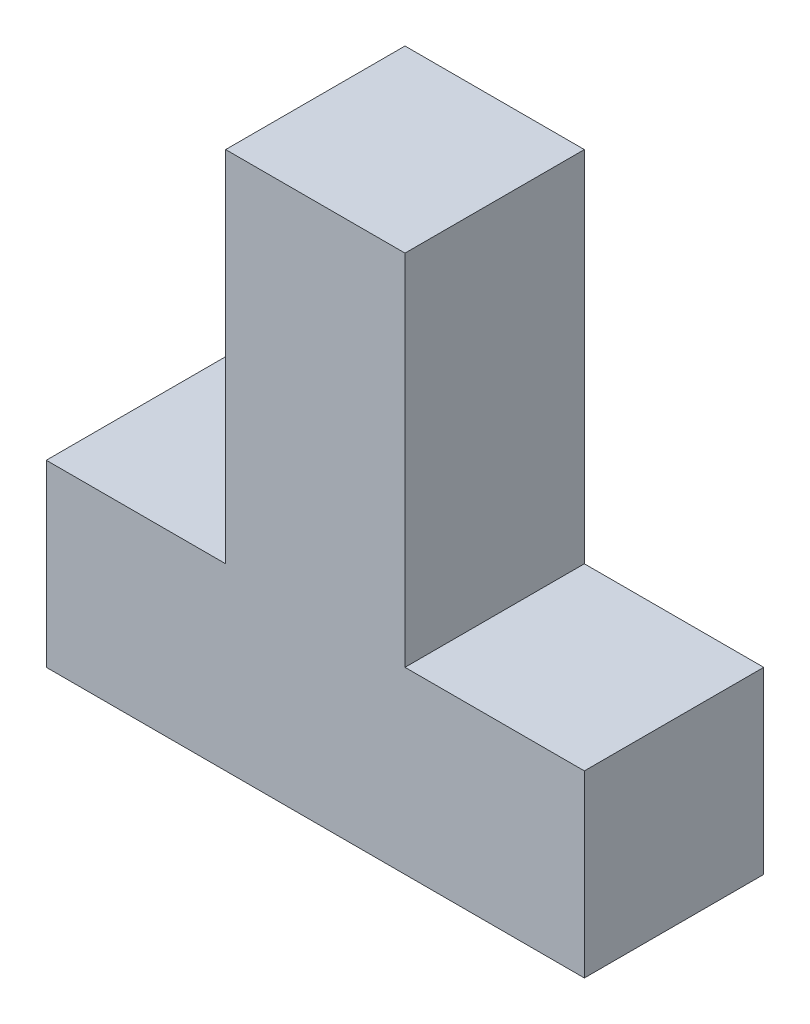
ISO-10303-21;
HEADER;
FILE_DESCRIPTION(('STEP AP214'),'2;1');
FILE_NAME('part.step','',(''),(''),'','','');
FILE_SCHEMA(('AUTOMOTIVE_DESIGN { 1 0 10303 214 1 1 1 1 }'));
ENDSEC;
DATA;
#1=APPLICATION_CONTEXT('core data for automotive mechanical design processes');
#2=APPLICATION_PROTOCOL_DEFINITION('international standard','automotive_design',2000,#1);
#3=PRODUCT_CONTEXT('',#1,'mechanical');
#4=PRODUCT('Part','Part','',(#3));
#5=PRODUCT_RELATED_PRODUCT_CATEGORY('part','',(#4));
#6=PRODUCT_DEFINITION_FORMATION('','',#4);
#7=PRODUCT_DEFINITION_CONTEXT('part definition',#1,'design');
#8=PRODUCT_DEFINITION('design','',#6,#7);
#9=PRODUCT_DEFINITION_SHAPE('','',#8);
#10=(LENGTH_UNIT() NAMED_UNIT(*) SI_UNIT(.MILLI.,.METRE.));
#11=(NAMED_UNIT(*) PLANE_ANGLE_UNIT() SI_UNIT($,.RADIAN.));
#12=(NAMED_UNIT(*) SI_UNIT($,.STERADIAN.) SOLID_ANGLE_UNIT());
#13=UNCERTAINTY_MEASURE_WITH_UNIT(LENGTH_MEASURE(1.E-05),#10,'distance_accuracy_value','');
#14=(GEOMETRIC_REPRESENTATION_CONTEXT(3) GLOBAL_UNCERTAINTY_ASSIGNED_CONTEXT((#13)) GLOBAL_UNIT_ASSIGNED_CONTEXT((#10,
#11,#12)) REPRESENTATION_CONTEXT('',''));
#15=CARTESIAN_POINT('',(0.,0.,0.));
#16=DIRECTION('',(0.,0.,1.));
#17=DIRECTION('',(1.,0.,0.));
#18=AXIS2_PLACEMENT_3D('',#15,#16,#17);
#19=CARTESIAN_POINT('',(0.,0.,25.4));
#20=DIRECTION('',(0.,1.,0.));
#21=DIRECTION('',(0.,0.,1.));
#22=AXIS2_PLACEMENT_3D('',#19,#20,#21);
#23=PLANE('',#22);
#24=DIRECTION('',(1.,0.,0.));
#25=VECTOR('',#24,1.);
#26=CARTESIAN_POINT('',(0.,0.,0.));
#27=LINE('',#26,#25);
#28=CARTESIAN_POINT('',(0.,0.,0.));
#29=VERTEX_POINT('',#28);
#30=CARTESIAN_POINT('',(76.2,0.,0.));
#31=VERTEX_POINT('',#30);
#32=EDGE_CURVE('E129',#29,#31,#27,.T.);
#33=ORIENTED_EDGE('',*,*,#32,.T.);
#34=DIRECTION('',(0.,0.,-1.));
#35=VECTOR('',#34,1.);
#36=CARTESIAN_POINT('',(76.2,0.,25.4));
#37=LINE('',#36,#35);
#38=CARTESIAN_POINT('',(76.2,0.,25.4));
#39=VERTEX_POINT('',#38);
#40=EDGE_CURVE('E11',#39,#31,#37,.T.);
#41=ORIENTED_EDGE('',*,*,#40,.F.);
#42=DIRECTION('',(1.,0.,0.));
#43=VECTOR('',#42,1.);
#44=CARTESIAN_POINT('',(0.,0.,25.4));
#45=LINE('',#44,#43);
#46=CARTESIAN_POINT('',(0.,0.,25.4));
#47=VERTEX_POINT('',#46);
#48=EDGE_CURVE('E143',#47,#39,#45,.T.);
#49=ORIENTED_EDGE('',*,*,#48,.F.);
#50=DIRECTION('',(0.,0.,-1.));
#51=VECTOR('',#50,1.);
#52=CARTESIAN_POINT('',(0.,0.,25.4));
#53=LINE('',#52,#51);
#54=EDGE_CURVE('E125',#47,#29,#53,.T.);
#55=ORIENTED_EDGE('',*,*,#54,.T.);
#56=EDGE_LOOP('',(#33,#41,#49,#55));
#57=FACE_BOUND('',#56,.T.);
#58=ADVANCED_FACE('F33',(#57),#23,.F.);
#59=CARTESIAN_POINT('',(76.2,0.,25.4));
#60=DIRECTION('',(-1.,0.,0.));
#61=DIRECTION('',(0.,0.,1.));
#62=AXIS2_PLACEMENT_3D('',#59,#60,#61);
#63=PLANE('',#62);
#64=DIRECTION('',(0.,1.,0.));
#65=VECTOR('',#64,1.);
#66=CARTESIAN_POINT('',(76.2,0.,0.));
#67=LINE('',#66,#65);
#68=CARTESIAN_POINT('',(76.2,25.4,0.));
#69=VERTEX_POINT('',#68);
#70=EDGE_CURVE('E132',#31,#69,#67,.T.);
#71=ORIENTED_EDGE('',*,*,#70,.T.);
#72=DIRECTION('',(0.,0.,-1.));
#73=VECTOR('',#72,1.);
#74=CARTESIAN_POINT('',(76.2,25.4,25.4));
#75=LINE('',#74,#73);
#76=CARTESIAN_POINT('',(76.2,25.4,25.4));
#77=VERTEX_POINT('',#76);
#78=EDGE_CURVE('E41',#77,#69,#75,.T.);
#79=ORIENTED_EDGE('',*,*,#78,.F.);
#80=DIRECTION('',(0.,1.,0.));
#81=VECTOR('',#80,1.);
#82=CARTESIAN_POINT('',(76.2,0.,25.4));
#83=LINE('',#82,#81);
#84=EDGE_CURVE('E92',#39,#77,#83,.T.);
#85=ORIENTED_EDGE('',*,*,#84,.F.);
#86=ORIENTED_EDGE('',*,*,#40,.T.);
#87=EDGE_LOOP('',(#71,#79,#85,#86));
#88=FACE_BOUND('',#87,.T.);
#89=ADVANCED_FACE('F178',(#88),#63,.F.);
#90=CARTESIAN_POINT('',(76.2,25.4,25.4));
#91=DIRECTION('',(0.,-1.,0.));
#92=DIRECTION('',(0.,0.,-1.));
#93=AXIS2_PLACEMENT_3D('',#90,#91,#92);
#94=PLANE('',#93);
#95=DIRECTION('',(-1.,0.,0.));
#96=VECTOR('',#95,1.);
#97=CARTESIAN_POINT('',(76.2,25.4,0.));
#98=LINE('',#97,#96);
#99=CARTESIAN_POINT('',(50.8,25.4,0.));
#100=VERTEX_POINT('',#99);
#101=EDGE_CURVE('E134',#69,#100,#98,.T.);
#102=ORIENTED_EDGE('',*,*,#101,.T.);
#103=DIRECTION('',(0.,0.,-1.));
#104=VECTOR('',#103,1.);
#105=CARTESIAN_POINT('',(50.8,25.4,25.4));
#106=LINE('',#105,#104);
#107=CARTESIAN_POINT('',(50.8,25.4,25.4));
#108=VERTEX_POINT('',#107);
#109=EDGE_CURVE('E150',#108,#100,#106,.T.);
#110=ORIENTED_EDGE('',*,*,#109,.F.);
#111=DIRECTION('',(-1.,0.,0.));
#112=VECTOR('',#111,1.);
#113=CARTESIAN_POINT('',(76.2,25.4,25.4));
#114=LINE('',#113,#112);
#115=EDGE_CURVE('E158',#77,#108,#114,.T.);
#116=ORIENTED_EDGE('',*,*,#115,.F.);
#117=ORIENTED_EDGE('',*,*,#78,.T.);
#118=EDGE_LOOP('',(#102,#110,#116,#117));
#119=FACE_BOUND('',#118,.T.);
#120=ADVANCED_FACE('F156',(#119),#94,.F.);
#121=CARTESIAN_POINT('',(50.8,25.4,25.4));
#122=DIRECTION('',(-1.,0.,0.));
#123=DIRECTION('',(0.,0.,1.));
#124=AXIS2_PLACEMENT_3D('',#121,#122,#123);
#125=PLANE('',#124);
#126=DIRECTION('',(0.,1.,0.));
#127=VECTOR('',#126,1.);
#128=CARTESIAN_POINT('',(50.8,25.4,0.));
#129=LINE('',#128,#127);
#130=CARTESIAN_POINT('',(50.8,76.2,0.));
#131=VERTEX_POINT('',#130);
#132=EDGE_CURVE('E136',#100,#131,#129,.T.);
#133=ORIENTED_EDGE('',*,*,#132,.T.);
#134=DIRECTION('',(0.,0.,-1.));
#135=VECTOR('',#134,1.);
#136=CARTESIAN_POINT('',(50.8,76.2,25.4));
#137=LINE('',#136,#135);
#138=CARTESIAN_POINT('',(50.8,76.2,25.4));
#139=VERTEX_POINT('',#138);
#140=EDGE_CURVE('E147',#139,#131,#137,.T.);
#141=ORIENTED_EDGE('',*,*,#140,.F.);
#142=DIRECTION('',(0.,1.,0.));
#143=VECTOR('',#142,1.);
#144=CARTESIAN_POINT('',(50.8,25.4,25.4));
#145=LINE('',#144,#143);
#146=EDGE_CURVE('E170',#108,#139,#145,.T.);
#147=ORIENTED_EDGE('',*,*,#146,.F.);
#148=ORIENTED_EDGE('',*,*,#109,.T.);
#149=EDGE_LOOP('',(#133,#141,#147,#148));
#150=FACE_BOUND('',#149,.T.);
#151=ADVANCED_FACE('F166',(#150),#125,.F.);
#152=CARTESIAN_POINT('',(50.8,76.2,25.4));
#153=DIRECTION('',(0.,-1.,0.));
#154=DIRECTION('',(0.,0.,-1.));
#155=AXIS2_PLACEMENT_3D('',#152,#153,#154);
#156=PLANE('',#155);
#157=DIRECTION('',(-1.,0.,0.));
#158=VECTOR('',#157,1.);
#159=CARTESIAN_POINT('',(50.8,76.2,0.));
#160=LINE('',#159,#158);
#161=CARTESIAN_POINT('',(25.4,76.2,0.));
#162=VERTEX_POINT('',#161);
#163=EDGE_CURVE('E138',#131,#162,#160,.T.);
#164=ORIENTED_EDGE('',*,*,#163,.T.);
#165=DIRECTION('',(0.,0.,-1.));
#166=VECTOR('',#165,1.);
#167=CARTESIAN_POINT('',(25.4,76.2,25.4));
#168=LINE('',#167,#166);
#169=CARTESIAN_POINT('',(25.4,76.2,25.4));
#170=VERTEX_POINT('',#169);
#171=EDGE_CURVE('E120',#170,#162,#168,.T.);
#172=ORIENTED_EDGE('',*,*,#171,.F.);
#173=DIRECTION('',(-1.,0.,0.));
#174=VECTOR('',#173,1.);
#175=CARTESIAN_POINT('',(50.8,76.2,25.4));
#176=LINE('',#175,#174);
#177=EDGE_CURVE('E111',#139,#170,#176,.T.);
#178=ORIENTED_EDGE('',*,*,#177,.F.);
#179=ORIENTED_EDGE('',*,*,#140,.T.);
#180=EDGE_LOOP('',(#164,#172,#178,#179));
#181=FACE_BOUND('',#180,.T.);
#182=ADVANCED_FACE('F169',(#181),#156,.F.);
#183=CARTESIAN_POINT('',(25.4,76.2,25.4));
#184=DIRECTION('',(1.,0.,0.));
#185=DIRECTION('',(0.,0.,-1.));
#186=AXIS2_PLACEMENT_3D('',#183,#184,#185);
#187=PLANE('',#186);
#188=DIRECTION('',(0.,-1.,0.));
#189=VECTOR('',#188,1.);
#190=CARTESIAN_POINT('',(25.4,76.2,0.));
#191=LINE('',#190,#189);
#192=CARTESIAN_POINT('',(25.4,25.4,0.));
#193=VERTEX_POINT('',#192);
#194=EDGE_CURVE('E119',#162,#193,#191,.T.);
#195=ORIENTED_EDGE('',*,*,#194,.T.);
#196=DIRECTION('',(0.,0.,-1.));
#197=VECTOR('',#196,1.);
#198=CARTESIAN_POINT('',(25.4,25.4,25.4));
#199=LINE('',#198,#197);
#200=CARTESIAN_POINT('',(25.4,25.4,25.4));
#201=VERTEX_POINT('',#200);
#202=EDGE_CURVE('E116',#201,#193,#199,.T.);
#203=ORIENTED_EDGE('',*,*,#202,.F.);
#204=DIRECTION('',(0.,-1.,0.));
#205=VECTOR('',#204,1.);
#206=CARTESIAN_POINT('',(25.4,76.2,25.4));
#207=LINE('',#206,#205);
#208=EDGE_CURVE('E105',#170,#201,#207,.T.);
#209=ORIENTED_EDGE('',*,*,#208,.F.);
#210=ORIENTED_EDGE('',*,*,#171,.T.);
#211=EDGE_LOOP('',(#195,#203,#209,#210));
#212=FACE_BOUND('',#211,.T.);
#213=ADVANCED_FACE('F117',(#212),#187,.F.);
#214=CARTESIAN_POINT('',(25.4,25.4,25.4));
#215=DIRECTION('',(0.,-1.,0.));
#216=DIRECTION('',(0.,0.,-1.));
#217=AXIS2_PLACEMENT_3D('',#214,#215,#216);
#218=PLANE('',#217);
#219=DIRECTION('',(-1.,0.,0.));
#220=VECTOR('',#219,1.);
#221=CARTESIAN_POINT('',(25.4,25.4,0.));
#222=LINE('',#221,#220);
#223=CARTESIAN_POINT('',(0.,25.4,0.));
#224=VERTEX_POINT('',#223);
#225=EDGE_CURVE('E78',#193,#224,#222,.T.);
#226=ORIENTED_EDGE('',*,*,#225,.T.);
#227=DIRECTION('',(0.,0.,-1.));
#228=VECTOR('',#227,1.);
#229=CARTESIAN_POINT('',(0.,25.4,25.4));
#230=LINE('',#229,#228);
#231=CARTESIAN_POINT('',(0.,25.4,25.4));
#232=VERTEX_POINT('',#231);
#233=EDGE_CURVE('E121',#232,#224,#230,.T.);
#234=ORIENTED_EDGE('',*,*,#233,.F.);
#235=DIRECTION('',(-1.,0.,0.));
#236=VECTOR('',#235,1.);
#237=CARTESIAN_POINT('',(25.4,25.4,25.4));
#238=LINE('',#237,#236);
#239=EDGE_CURVE('E109',#201,#232,#238,.T.);
#240=ORIENTED_EDGE('',*,*,#239,.F.);
#241=ORIENTED_EDGE('',*,*,#202,.T.);
#242=EDGE_LOOP('',(#226,#234,#240,#241));
#243=FACE_BOUND('',#242,.T.);
#244=ADVANCED_FACE('F123',(#243),#218,.F.);
#245=CARTESIAN_POINT('',(0.,25.4,25.4));
#246=DIRECTION('',(1.,0.,0.));
#247=DIRECTION('',(0.,0.,-1.));
#248=AXIS2_PLACEMENT_3D('',#245,#246,#247);
#249=PLANE('',#248);
#250=DIRECTION('',(0.,-1.,0.));
#251=VECTOR('',#250,1.);
#252=CARTESIAN_POINT('',(0.,25.4,0.));
#253=LINE('',#252,#251);
#254=EDGE_CURVE('E84',#224,#29,#253,.T.);
#255=ORIENTED_EDGE('',*,*,#254,.T.);
#256=ORIENTED_EDGE('',*,*,#54,.F.);
#257=DIRECTION('',(0.,-1.,0.));
#258=VECTOR('',#257,1.);
#259=CARTESIAN_POINT('',(0.,25.4,25.4));
#260=LINE('',#259,#258);
#261=EDGE_CURVE('E49',#232,#47,#260,.T.);
#262=ORIENTED_EDGE('',*,*,#261,.F.);
#263=ORIENTED_EDGE('',*,*,#233,.T.);
#264=EDGE_LOOP('',(#255,#256,#262,#263));
#265=FACE_BOUND('',#264,.T.);
#266=ADVANCED_FACE('F194',(#265),#249,.F.);
#267=CARTESIAN_POINT('',(0.,0.,25.4));
#268=DIRECTION('',(0.,0.,1.));
#269=DIRECTION('',(1.,0.,0.));
#270=AXIS2_PLACEMENT_3D('',#267,#268,#269);
#271=PLANE('',#270);
#272=ORIENTED_EDGE('',*,*,#48,.T.);
#273=ORIENTED_EDGE('',*,*,#84,.T.);
#274=ORIENTED_EDGE('',*,*,#115,.T.);
#275=ORIENTED_EDGE('',*,*,#146,.T.);
#276=ORIENTED_EDGE('',*,*,#177,.T.);
#277=ORIENTED_EDGE('',*,*,#208,.T.);
#278=ORIENTED_EDGE('',*,*,#239,.T.);
#279=ORIENTED_EDGE('',*,*,#261,.T.);
#280=EDGE_LOOP('',(#272,#273,#274,#275,#276,#277,#278,#279));
#281=FACE_BOUND('',#280,.T.);
#282=ADVANCED_FACE('F107',(#281),#271,.T.);
#283=CARTESIAN_POINT('',(0.,0.,0.));
#284=DIRECTION('',(0.,0.,1.));
#285=DIRECTION('',(1.,0.,0.));
#286=AXIS2_PLACEMENT_3D('',#283,#284,#285);
#287=PLANE('',#286);
#288=ORIENTED_EDGE('',*,*,#32,.F.);
#289=ORIENTED_EDGE('',*,*,#254,.F.);
#290=ORIENTED_EDGE('',*,*,#225,.F.);
#291=ORIENTED_EDGE('',*,*,#194,.F.);
#292=ORIENTED_EDGE('',*,*,#163,.F.);
#293=ORIENTED_EDGE('',*,*,#132,.F.);
#294=ORIENTED_EDGE('',*,*,#101,.F.);
#295=ORIENTED_EDGE('',*,*,#70,.F.);
#296=EDGE_LOOP('',(#288,#289,#290,#291,#292,#293,#294,#295));
#297=FACE_BOUND('',#296,.T.);
#298=ADVANCED_FACE('F162',(#297),#287,.F.);
#299=CLOSED_SHELL('',(#58,#89,#120,#151,#182,#213,#244,#266,#282,#298));
#300=MANIFOLD_SOLID_BREP('B2',#299);
#301=ADVANCED_BREP_SHAPE_REPRESENTATION('',(#18,#300),#14);
#302=SHAPE_DEFINITION_REPRESENTATION(#9,#301);
ENDSEC;
END-ISO-10303-21;
